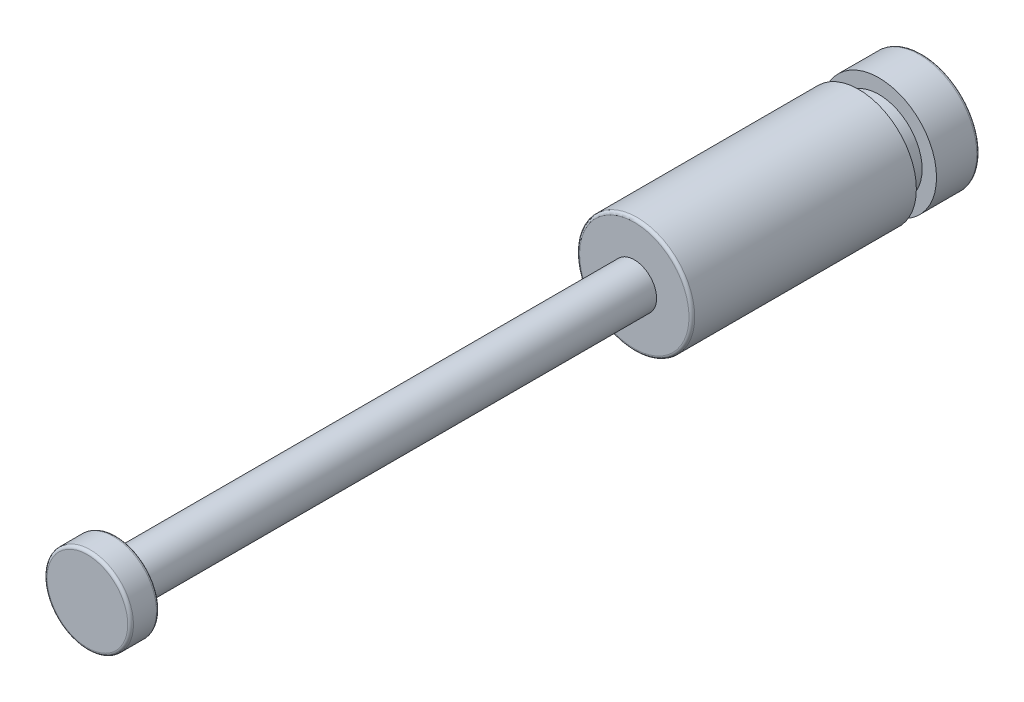
ISO-10303-21;
HEADER;
FILE_DESCRIPTION(('STEP AP214'),'2;1');
FILE_NAME('part.step','',(''),(''),'','','');
FILE_SCHEMA(('AUTOMOTIVE_DESIGN { 1 0 10303 214 1 1 1 1 }'));
ENDSEC;
DATA;
#1=APPLICATION_CONTEXT('core data for automotive mechanical design processes');
#2=APPLICATION_PROTOCOL_DEFINITION('international standard','automotive_design',2000,#1);
#3=PRODUCT_CONTEXT('',#1,'mechanical');
#4=PRODUCT('Part','Part','',(#3));
#5=PRODUCT_RELATED_PRODUCT_CATEGORY('part','',(#4));
#6=PRODUCT_DEFINITION_FORMATION('','',#4);
#7=PRODUCT_DEFINITION_CONTEXT('part definition',#1,'design');
#8=PRODUCT_DEFINITION('design','',#6,#7);
#9=PRODUCT_DEFINITION_SHAPE('','',#8);
#10=(LENGTH_UNIT() NAMED_UNIT(*) SI_UNIT(.MILLI.,.METRE.));
#11=(NAMED_UNIT(*) PLANE_ANGLE_UNIT() SI_UNIT($,.RADIAN.));
#12=(NAMED_UNIT(*) SI_UNIT($,.STERADIAN.) SOLID_ANGLE_UNIT());
#13=UNCERTAINTY_MEASURE_WITH_UNIT(LENGTH_MEASURE(1.E-05),#10,'distance_accuracy_value','');
#14=(GEOMETRIC_REPRESENTATION_CONTEXT(3) GLOBAL_UNCERTAINTY_ASSIGNED_CONTEXT((#13)) GLOBAL_UNIT_ASSIGNED_CONTEXT((#10,
#11,#12)) REPRESENTATION_CONTEXT('',''));
#15=CARTESIAN_POINT('',(0.,0.,0.));
#16=DIRECTION('',(0.,0.,1.));
#17=DIRECTION('',(1.,0.,0.));
#18=AXIS2_PLACEMENT_3D('',#15,#16,#17);
#19=CARTESIAN_POINT('',(0.,0.,-10.));
#20=DIRECTION('',(0.,0.,1.));
#21=DIRECTION('',(1.,0.,0.));
#22=AXIS2_PLACEMENT_3D('',#19,#20,#21);
#23=CYLINDRICAL_SURFACE('',#22,2.);
#24=CARTESIAN_POINT('',(0.,0.,-0.0999999999999994));
#25=DIRECTION('',(0.,0.,-1.));
#26=DIRECTION('',(-1.,0.,0.));
#27=AXIS2_PLACEMENT_3D('',#24,#25,#26);
#28=CIRCLE('',#27,2.);
#29=CARTESIAN_POINT('',(-2.,0.,-0.0999999999999994));
#30=VERTEX_POINT('',#29);
#31=EDGE_CURVE('E58',#30,#30,#28,.T.);
#32=ORIENTED_EDGE('',*,*,#31,.T.);
#33=EDGE_LOOP('',(#32));
#34=FACE_BOUND('',#33,.T.);
#35=CARTESIAN_POINT('',(0.,0.,-7.8));
#36=DIRECTION('',(0.,0.,1.));
#37=DIRECTION('',(1.,0.,0.));
#38=AXIS2_PLACEMENT_3D('',#35,#36,#37);
#39=CIRCLE('',#38,2.);
#40=CARTESIAN_POINT('',(2.,0.,-7.8));
#41=VERTEX_POINT('',#40);
#42=EDGE_CURVE('E96',#41,#41,#39,.T.);
#43=ORIENTED_EDGE('',*,*,#42,.T.);
#44=EDGE_LOOP('',(#43));
#45=FACE_BOUND('',#44,.T.);
#46=ADVANCED_FACE('F36',(#34,#45),#23,.T.);
#47=CARTESIAN_POINT('',(0.,0.,18.));
#48=DIRECTION('',(0.,0.,-1.));
#49=DIRECTION('',(-1.,0.,0.));
#50=AXIS2_PLACEMENT_3D('',#47,#48,#49);
#51=CYLINDRICAL_SURFACE('',#50,0.775000000000001);
#52=CARTESIAN_POINT('',(0.,0.,18.));
#53=DIRECTION('',(0.,0.,1.));
#54=DIRECTION('',(1.,0.,0.));
#55=AXIS2_PLACEMENT_3D('',#52,#53,#54);
#56=CIRCLE('',#55,0.775000000000001);
#57=CARTESIAN_POINT('',(0.775000000000001,0.,18.));
#58=VERTEX_POINT('',#57);
#59=EDGE_CURVE('E76',#58,#58,#56,.T.);
#60=ORIENTED_EDGE('',*,*,#59,.F.);
#61=EDGE_LOOP('',(#60));
#62=FACE_BOUND('',#61,.T.);
#63=CARTESIAN_POINT('',(0.,0.,0.));
#64=DIRECTION('',(0.,0.,-1.));
#65=DIRECTION('',(-1.,0.,0.));
#66=AXIS2_PLACEMENT_3D('',#63,#64,#65);
#67=CIRCLE('',#66,0.775000000000001);
#68=CARTESIAN_POINT('',(-0.775000000000001,0.,0.));
#69=VERTEX_POINT('',#68);
#70=EDGE_CURVE('E80',#69,#69,#67,.T.);
#71=ORIENTED_EDGE('',*,*,#70,.F.);
#72=EDGE_LOOP('',(#71));
#73=FACE_BOUND('',#72,.T.);
#74=ADVANCED_FACE('F120',(#62,#73),#51,.T.);
#75=CARTESIAN_POINT('',(0.,0.,18.));
#76=DIRECTION('',(0.,0.,1.));
#77=DIRECTION('',(1.,0.,0.));
#78=AXIS2_PLACEMENT_3D('',#75,#76,#77);
#79=PLANE('',#78);
#80=CARTESIAN_POINT('',(0.,0.,18.));
#81=DIRECTION('',(0.,0.,1.));
#82=DIRECTION('',(1.,0.,0.));
#83=AXIS2_PLACEMENT_3D('',#80,#81,#82);
#84=CIRCLE('',#83,1.4);
#85=CARTESIAN_POINT('',(1.4,0.,18.));
#86=VERTEX_POINT('',#85);
#87=EDGE_CURVE('E67',#86,#86,#84,.F.);
#88=ORIENTED_EDGE('',*,*,#87,.T.);
#89=EDGE_LOOP('',(#88));
#90=FACE_BOUND('',#89,.T.);
#91=ORIENTED_EDGE('',*,*,#59,.T.);
#92=EDGE_LOOP('',(#91));
#93=FACE_BOUND('',#92,.T.);
#94=ADVANCED_FACE('F127',(#90,#93),#79,.F.);
#95=CARTESIAN_POINT('',(0.,0.,19.));
#96=DIRECTION('',(0.,0.,-1.));
#97=DIRECTION('',(-1.,0.,0.));
#98=AXIS2_PLACEMENT_3D('',#95,#96,#97);
#99=CYLINDRICAL_SURFACE('',#98,1.5);
#100=CARTESIAN_POINT('',(0.,0.,18.1));
#101=DIRECTION('',(0.,0.,1.));
#102=DIRECTION('',(1.,0.,0.));
#103=AXIS2_PLACEMENT_3D('',#100,#101,#102);
#104=CIRCLE('',#103,1.5);
#105=CARTESIAN_POINT('',(1.5,0.,18.1));
#106=VERTEX_POINT('',#105);
#107=EDGE_CURVE('E70',#106,#106,#104,.T.);
#108=ORIENTED_EDGE('',*,*,#107,.T.);
#109=EDGE_LOOP('',(#108));
#110=FACE_BOUND('',#109,.T.);
#111=CARTESIAN_POINT('',(0.,0.,18.9));
#112=DIRECTION('',(0.,0.,1.));
#113=DIRECTION('',(1.,0.,0.));
#114=AXIS2_PLACEMENT_3D('',#111,#112,#113);
#115=CIRCLE('',#114,1.5);
#116=CARTESIAN_POINT('',(1.5,0.,18.9));
#117=VERTEX_POINT('',#116);
#118=EDGE_CURVE('E73',#117,#117,#115,.F.);
#119=ORIENTED_EDGE('',*,*,#118,.T.);
#120=EDGE_LOOP('',(#119));
#121=FACE_BOUND('',#120,.T.);
#122=ADVANCED_FACE('F236',(#110,#121),#99,.T.);
#123=CARTESIAN_POINT('',(0.,0.,19.));
#124=DIRECTION('',(0.,0.,1.));
#125=DIRECTION('',(1.,0.,0.));
#126=AXIS2_PLACEMENT_3D('',#123,#124,#125);
#127=PLANE('',#126);
#128=CARTESIAN_POINT('',(0.,0.,19.));
#129=DIRECTION('',(0.,0.,1.));
#130=DIRECTION('',(1.,0.,0.));
#131=AXIS2_PLACEMENT_3D('',#128,#129,#130);
#132=CIRCLE('',#131,1.4);
#133=CARTESIAN_POINT('',(1.4,0.,19.));
#134=VERTEX_POINT('',#133);
#135=EDGE_CURVE('E64',#134,#134,#132,.T.);
#136=ORIENTED_EDGE('',*,*,#135,.T.);
#137=EDGE_LOOP('',(#136));
#138=FACE_BOUND('',#137,.T.);
#139=ADVANCED_FACE('F115',(#138),#127,.T.);
#140=CARTESIAN_POINT('',(0.,0.,0.));
#141=DIRECTION('',(0.,0.,-1.));
#142=DIRECTION('',(-1.,0.,0.));
#143=AXIS2_PLACEMENT_3D('',#140,#141,#142);
#144=PLANE('',#143);
#145=CARTESIAN_POINT('',(0.,0.,0.));
#146=DIRECTION('',(0.,0.,-1.));
#147=DIRECTION('',(-1.,0.,0.));
#148=AXIS2_PLACEMENT_3D('',#145,#146,#147);
#149=CIRCLE('',#148,1.9);
#150=CARTESIAN_POINT('',(-1.9,0.,0.));
#151=VERTEX_POINT('',#150);
#152=EDGE_CURVE('E51',#151,#151,#149,.F.);
#153=ORIENTED_EDGE('',*,*,#152,.T.);
#154=EDGE_LOOP('',(#153));
#155=FACE_BOUND('',#154,.T.);
#156=ORIENTED_EDGE('',*,*,#70,.T.);
#157=EDGE_LOOP('',(#156));
#158=FACE_BOUND('',#157,.T.);
#159=ADVANCED_FACE('F105',(#155,#158),#144,.F.);
#160=CARTESIAN_POINT('',(0.,2.,-7.8));
#161=DIRECTION('',(0.,0.,-1.));
#162=DIRECTION('',(-1.,0.,0.));
#163=AXIS2_PLACEMENT_3D('',#160,#161,#162);
#164=PLANE('',#163);
#165=CARTESIAN_POINT('',(0.,0.,-7.8));
#166=DIRECTION('',(0.,0.,1.));
#167=DIRECTION('',(1.,0.,0.));
#168=AXIS2_PLACEMENT_3D('',#165,#166,#167);
#169=CIRCLE('',#168,1.5);
#170=CARTESIAN_POINT('',(1.5,0.,-7.8));
#171=VERTEX_POINT('',#170);
#172=EDGE_CURVE('E84',#171,#171,#169,.T.);
#173=ORIENTED_EDGE('',*,*,#172,.T.);
#174=EDGE_LOOP('',(#173));
#175=FACE_BOUND('',#174,.T.);
#176=ORIENTED_EDGE('',*,*,#42,.F.);
#177=EDGE_LOOP('',(#176));
#178=FACE_BOUND('',#177,.T.);
#179=ADVANCED_FACE('F102',(#175,#178),#164,.T.);
#180=CARTESIAN_POINT('',(0.,0.,0.));
#181=DIRECTION('',(0.,0.,1.));
#182=DIRECTION('',(1.,0.,0.));
#183=AXIS2_PLACEMENT_3D('',#180,#181,#182);
#184=CYLINDRICAL_SURFACE('',#183,1.5);
#185=CARTESIAN_POINT('',(0.,0.,-8.5));
#186=DIRECTION('',(0.,0.,1.));
#187=DIRECTION('',(1.,0.,0.));
#188=AXIS2_PLACEMENT_3D('',#185,#186,#187);
#189=CIRCLE('',#188,1.5);
#190=CARTESIAN_POINT('',(1.5,0.,-8.5));
#191=VERTEX_POINT('',#190);
#192=EDGE_CURVE('E88',#191,#191,#189,.T.);
#193=ORIENTED_EDGE('',*,*,#192,.T.);
#194=EDGE_LOOP('',(#193));
#195=FACE_BOUND('',#194,.T.);
#196=ORIENTED_EDGE('',*,*,#172,.F.);
#197=EDGE_LOOP('',(#196));
#198=FACE_BOUND('',#197,.T.);
#199=ADVANCED_FACE('F104',(#195,#198),#184,.T.);
#200=CARTESIAN_POINT('',(0.,2.,-8.5));
#201=DIRECTION('',(0.,0.,1.));
#202=DIRECTION('',(1.,0.,0.));
#203=AXIS2_PLACEMENT_3D('',#200,#201,#202);
#204=PLANE('',#203);
#205=CARTESIAN_POINT('',(0.,0.,-8.5));
#206=DIRECTION('',(0.,0.,1.));
#207=DIRECTION('',(1.,0.,0.));
#208=AXIS2_PLACEMENT_3D('',#205,#206,#207);
#209=CIRCLE('',#208,2.);
#210=CARTESIAN_POINT('',(2.,0.,-8.5));
#211=VERTEX_POINT('',#210);
#212=EDGE_CURVE('E92',#211,#211,#209,.T.);
#213=ORIENTED_EDGE('',*,*,#212,.T.);
#214=EDGE_LOOP('',(#213));
#215=FACE_BOUND('',#214,.T.);
#216=ORIENTED_EDGE('',*,*,#192,.F.);
#217=EDGE_LOOP('',(#216));
#218=FACE_BOUND('',#217,.T.);
#219=ADVANCED_FACE('F112',(#215,#218),#204,.T.);
#220=CARTESIAN_POINT('',(0.,0.,-10.));
#221=DIRECTION('',(0.,0.,-1.));
#222=DIRECTION('',(-1.,0.,0.));
#223=AXIS2_PLACEMENT_3D('',#220,#221,#222);
#224=PLANE('',#223);
#225=CARTESIAN_POINT('',(0.,0.,-10.));
#226=DIRECTION('',(0.,0.,-1.));
#227=DIRECTION('',(-1.,0.,0.));
#228=AXIS2_PLACEMENT_3D('',#225,#226,#227);
#229=CIRCLE('',#228,1.9);
#230=CARTESIAN_POINT('',(-1.9,0.,-10.));
#231=VERTEX_POINT('',#230);
#232=EDGE_CURVE('E44',#231,#231,#229,.T.);
#233=ORIENTED_EDGE('',*,*,#232,.T.);
#234=EDGE_LOOP('',(#233));
#235=FACE_BOUND('',#234,.T.);
#236=ADVANCED_FACE('F133',(#235),#224,.T.);
#237=CARTESIAN_POINT('',(0.,0.,-9.9));
#238=DIRECTION('',(0.,0.,-1.));
#239=DIRECTION('',(-1.,0.,0.));
#240=AXIS2_PLACEMENT_3D('',#237,#238,#239);
#241=CIRCLE('',#240,2.);
#242=CARTESIAN_POINT('',(-2.,0.,-9.9));
#243=VERTEX_POINT('',#242);
#244=EDGE_CURVE('E10',#243,#243,#241,.F.);
#245=ORIENTED_EDGE('',*,*,#244,.T.);
#246=EDGE_LOOP('',(#245));
#247=FACE_BOUND('',#246,.T.);
#248=ORIENTED_EDGE('',*,*,#212,.F.);
#249=EDGE_LOOP('',(#248));
#250=FACE_BOUND('',#249,.T.);
#251=ADVANCED_FACE('F123',(#247,#250),#23,.T.);
#252=CARTESIAN_POINT('',(0.,0.,18.1));
#253=DIRECTION('',(0.,0.,1.));
#254=DIRECTION('',(1.,0.,0.));
#255=AXIS2_PLACEMENT_3D('',#252,#253,#254);
#256=TOROIDAL_SURFACE('',#255,1.4,0.1);
#257=ORIENTED_EDGE('',*,*,#87,.F.);
#258=EDGE_LOOP('',(#257));
#259=FACE_BOUND('',#258,.T.);
#260=ORIENTED_EDGE('',*,*,#107,.F.);
#261=EDGE_LOOP('',(#260));
#262=FACE_BOUND('',#261,.T.);
#263=ADVANCED_FACE('F132',(#259,#262),#256,.T.);
#264=CARTESIAN_POINT('',(0.,0.,18.9));
#265=DIRECTION('',(0.,0.,1.));
#266=DIRECTION('',(1.,0.,0.));
#267=AXIS2_PLACEMENT_3D('',#264,#265,#266);
#268=TOROIDAL_SURFACE('',#267,1.4,0.1);
#269=ORIENTED_EDGE('',*,*,#118,.F.);
#270=EDGE_LOOP('',(#269));
#271=FACE_BOUND('',#270,.T.);
#272=ORIENTED_EDGE('',*,*,#135,.F.);
#273=EDGE_LOOP('',(#272));
#274=FACE_BOUND('',#273,.T.);
#275=ADVANCED_FACE('F138',(#271,#274),#268,.T.);
#276=CARTESIAN_POINT('',(0.,0.,-0.0999999999999994));
#277=DIRECTION('',(0.,0.,-1.));
#278=DIRECTION('',(-1.,0.,0.));
#279=AXIS2_PLACEMENT_3D('',#276,#277,#278);
#280=TOROIDAL_SURFACE('',#279,1.9,0.1);
#281=ORIENTED_EDGE('',*,*,#152,.F.);
#282=EDGE_LOOP('',(#281));
#283=FACE_BOUND('',#282,.T.);
#284=ORIENTED_EDGE('',*,*,#31,.F.);
#285=EDGE_LOOP('',(#284));
#286=FACE_BOUND('',#285,.T.);
#287=ADVANCED_FACE('F173',(#283,#286),#280,.T.);
#288=CARTESIAN_POINT('',(0.,0.,-9.9));
#289=DIRECTION('',(0.,0.,-1.));
#290=DIRECTION('',(-1.,0.,0.));
#291=AXIS2_PLACEMENT_3D('',#288,#289,#290);
#292=TOROIDAL_SURFACE('',#291,1.9,0.1);
#293=ORIENTED_EDGE('',*,*,#244,.F.);
#294=EDGE_LOOP('',(#293));
#295=FACE_BOUND('',#294,.T.);
#296=ORIENTED_EDGE('',*,*,#232,.F.);
#297=EDGE_LOOP('',(#296));
#298=FACE_BOUND('',#297,.T.);
#299=ADVANCED_FACE('F38',(#295,#298),#292,.T.);
#300=CLOSED_SHELL('',(#46,#74,#94,#122,#139,#159,#179,#199,#219,#236,#251,#263,#275,#287,#299));
#301=MANIFOLD_SOLID_BREP('B2',#300);
#302=ADVANCED_BREP_SHAPE_REPRESENTATION('',(#18,#301),#14);
#303=SHAPE_DEFINITION_REPRESENTATION(#9,#302);
ENDSEC;
END-ISO-10303-21;
